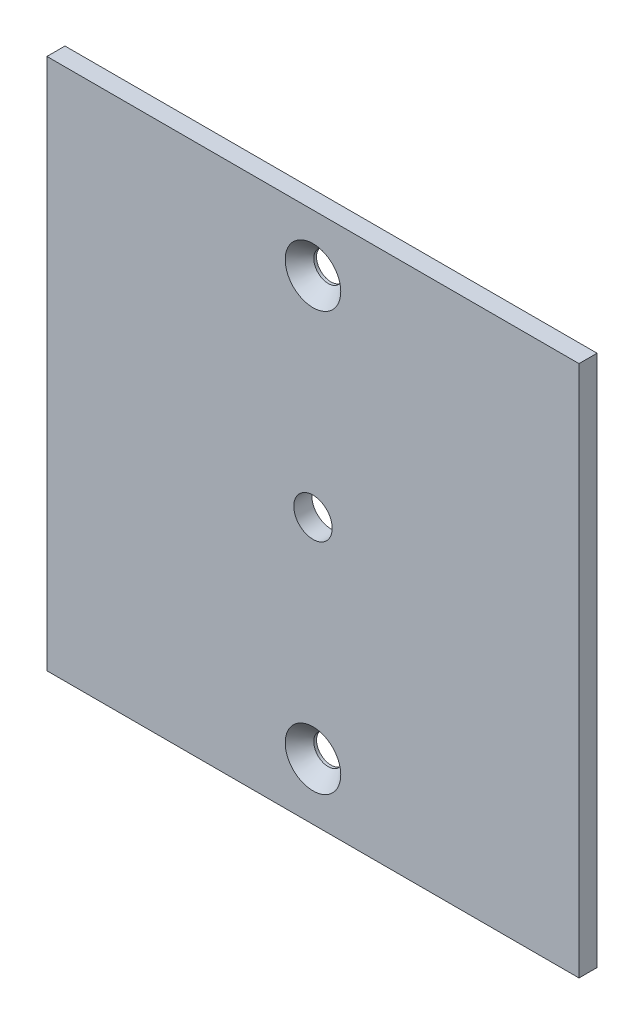
ISO-10303-21;
HEADER;
FILE_DESCRIPTION(('STEP AP214'),'2;1');
FILE_NAME('part.step','',(''),(''),'','','');
FILE_SCHEMA(('AUTOMOTIVE_DESIGN { 1 0 10303 214 1 1 1 1 }'));
ENDSEC;
DATA;
#1=APPLICATION_CONTEXT('core data for automotive mechanical design processes');
#2=APPLICATION_PROTOCOL_DEFINITION('international standard','automotive_design',2000,#1);
#3=PRODUCT_CONTEXT('',#1,'mechanical');
#4=PRODUCT('Part','Part','',(#3));
#5=PRODUCT_RELATED_PRODUCT_CATEGORY('part','',(#4));
#6=PRODUCT_DEFINITION_FORMATION('','',#4);
#7=PRODUCT_DEFINITION_CONTEXT('part definition',#1,'design');
#8=PRODUCT_DEFINITION('design','',#6,#7);
#9=PRODUCT_DEFINITION_SHAPE('','',#8);
#10=(LENGTH_UNIT() NAMED_UNIT(*) SI_UNIT(.MILLI.,.METRE.));
#11=(NAMED_UNIT(*) PLANE_ANGLE_UNIT() SI_UNIT($,.RADIAN.));
#12=(NAMED_UNIT(*) SI_UNIT($,.STERADIAN.) SOLID_ANGLE_UNIT());
#13=UNCERTAINTY_MEASURE_WITH_UNIT(LENGTH_MEASURE(1.E-05),#10,'distance_accuracy_value','');
#14=(GEOMETRIC_REPRESENTATION_CONTEXT(3) GLOBAL_UNCERTAINTY_ASSIGNED_CONTEXT((#13)) GLOBAL_UNIT_ASSIGNED_CONTEXT((#10,
#11,#12)) REPRESENTATION_CONTEXT('',''));
#15=CARTESIAN_POINT('',(0.,0.,0.));
#16=DIRECTION('',(0.,0.,1.));
#17=DIRECTION('',(1.,0.,0.));
#18=AXIS2_PLACEMENT_3D('',#15,#16,#17);
#19=CARTESIAN_POINT('',(46.824999949,-46.824999949,3.175));
#20=DIRECTION('',(-1.,0.,0.));
#21=DIRECTION('',(0.,0.,1.));
#22=AXIS2_PLACEMENT_3D('',#19,#20,#21);
#23=PLANE('',#22);
#24=DIRECTION('',(0.,1.,0.));
#25=VECTOR('',#24,1.);
#26=CARTESIAN_POINT('',(46.824999949,-46.824999949,0.));
#27=LINE('',#26,#25);
#28=CARTESIAN_POINT('',(46.824999949,-46.824999949,0.));
#29=VERTEX_POINT('',#28);
#30=CARTESIAN_POINT('',(46.824999949,46.824999949,0.));
#31=VERTEX_POINT('',#30);
#32=EDGE_CURVE('E105',#29,#31,#27,.T.);
#33=ORIENTED_EDGE('',*,*,#32,.T.);
#34=DIRECTION('',(0.,0.,-1.));
#35=VECTOR('',#34,1.);
#36=CARTESIAN_POINT('',(46.824999949,46.824999949,3.175));
#37=LINE('',#36,#35);
#38=CARTESIAN_POINT('',(46.824999949,46.824999949,3.175));
#39=VERTEX_POINT('',#38);
#40=EDGE_CURVE('E11',#39,#31,#37,.T.);
#41=ORIENTED_EDGE('',*,*,#40,.F.);
#42=DIRECTION('',(0.,1.,0.));
#43=VECTOR('',#42,1.);
#44=CARTESIAN_POINT('',(46.824999949,-46.824999949,3.175));
#45=LINE('',#44,#43);
#46=CARTESIAN_POINT('',(46.824999949,-46.824999949,3.175));
#47=VERTEX_POINT('',#46);
#48=EDGE_CURVE('E92',#47,#39,#45,.T.);
#49=ORIENTED_EDGE('',*,*,#48,.F.);
#50=DIRECTION('',(0.,0.,-1.));
#51=VECTOR('',#50,1.);
#52=CARTESIAN_POINT('',(46.824999949,-46.824999949,3.175));
#53=LINE('',#52,#51);
#54=EDGE_CURVE('E101',#47,#29,#53,.T.);
#55=ORIENTED_EDGE('',*,*,#54,.T.);
#56=EDGE_LOOP('',(#33,#41,#49,#55));
#57=FACE_BOUND('',#56,.T.);
#58=ADVANCED_FACE('F39',(#57),#23,.F.);
#59=CARTESIAN_POINT('',(-46.824999949,46.824999949,3.175));
#60=DIRECTION('',(0.,-1.,0.));
#61=DIRECTION('',(0.,0.,-1.));
#62=AXIS2_PLACEMENT_3D('',#59,#60,#61);
#63=PLANE('',#62);
#64=DIRECTION('',(-1.,0.,0.));
#65=VECTOR('',#64,1.);
#66=CARTESIAN_POINT('',(-46.824999949,46.824999949,0.));
#67=LINE('',#66,#65);
#68=CARTESIAN_POINT('',(-46.824999949,46.824999949,0.));
#69=VERTEX_POINT('',#68);
#70=EDGE_CURVE('E96',#31,#69,#67,.T.);
#71=ORIENTED_EDGE('',*,*,#70,.T.);
#72=DIRECTION('',(0.,0.,-1.));
#73=VECTOR('',#72,1.);
#74=CARTESIAN_POINT('',(-46.824999949,46.824999949,3.175));
#75=LINE('',#74,#73);
#76=CARTESIAN_POINT('',(-46.824999949,46.824999949,3.175));
#77=VERTEX_POINT('',#76);
#78=EDGE_CURVE('E48',#77,#69,#75,.T.);
#79=ORIENTED_EDGE('',*,*,#78,.F.);
#80=DIRECTION('',(-1.,0.,0.));
#81=VECTOR('',#80,1.);
#82=CARTESIAN_POINT('',(-46.824999949,46.824999949,3.175));
#83=LINE('',#82,#81);
#84=EDGE_CURVE('E87',#39,#77,#83,.T.);
#85=ORIENTED_EDGE('',*,*,#84,.F.);
#86=ORIENTED_EDGE('',*,*,#40,.T.);
#87=EDGE_LOOP('',(#71,#79,#85,#86));
#88=FACE_BOUND('',#87,.T.);
#89=ADVANCED_FACE('F95',(#88),#63,.F.);
#90=CARTESIAN_POINT('',(-46.824999949,-46.824999949,3.175));
#91=DIRECTION('',(1.,0.,0.));
#92=DIRECTION('',(0.,0.,-1.));
#93=AXIS2_PLACEMENT_3D('',#90,#91,#92);
#94=PLANE('',#93);
#95=DIRECTION('',(0.,-1.,0.));
#96=VECTOR('',#95,1.);
#97=CARTESIAN_POINT('',(-46.824999949,-46.824999949,0.));
#98=LINE('',#97,#96);
#99=CARTESIAN_POINT('',(-46.824999949,-46.824999949,0.));
#100=VERTEX_POINT('',#99);
#101=EDGE_CURVE('E74',#69,#100,#98,.T.);
#102=ORIENTED_EDGE('',*,*,#101,.T.);
#103=DIRECTION('',(0.,0.,-1.));
#104=VECTOR('',#103,1.);
#105=CARTESIAN_POINT('',(-46.824999949,-46.824999949,3.175));
#106=LINE('',#105,#104);
#107=CARTESIAN_POINT('',(-46.824999949,-46.824999949,3.175));
#108=VERTEX_POINT('',#107);
#109=EDGE_CURVE('E97',#108,#100,#106,.T.);
#110=ORIENTED_EDGE('',*,*,#109,.F.);
#111=DIRECTION('',(0.,-1.,0.));
#112=VECTOR('',#111,1.);
#113=CARTESIAN_POINT('',(-46.824999949,-46.824999949,3.175));
#114=LINE('',#113,#112);
#115=EDGE_CURVE('E90',#77,#108,#114,.T.);
#116=ORIENTED_EDGE('',*,*,#115,.F.);
#117=ORIENTED_EDGE('',*,*,#78,.T.);
#118=EDGE_LOOP('',(#102,#110,#116,#117));
#119=FACE_BOUND('',#118,.T.);
#120=ADVANCED_FACE('F99',(#119),#94,.F.);
#121=CARTESIAN_POINT('',(-46.824999949,-46.824999949,3.175));
#122=DIRECTION('',(0.,1.,0.));
#123=DIRECTION('',(0.,0.,1.));
#124=AXIS2_PLACEMENT_3D('',#121,#122,#123);
#125=PLANE('',#124);
#126=DIRECTION('',(1.,0.,0.));
#127=VECTOR('',#126,1.);
#128=CARTESIAN_POINT('',(-46.824999949,-46.824999949,0.));
#129=LINE('',#128,#127);
#130=EDGE_CURVE('E80',#100,#29,#129,.T.);
#131=ORIENTED_EDGE('',*,*,#130,.T.);
#132=ORIENTED_EDGE('',*,*,#54,.F.);
#133=DIRECTION('',(1.,0.,0.));
#134=VECTOR('',#133,1.);
#135=CARTESIAN_POINT('',(-46.824999949,-46.824999949,3.175));
#136=LINE('',#135,#134);
#137=EDGE_CURVE('E57',#108,#47,#136,.T.);
#138=ORIENTED_EDGE('',*,*,#137,.F.);
#139=ORIENTED_EDGE('',*,*,#109,.T.);
#140=EDGE_LOOP('',(#131,#132,#138,#139));
#141=FACE_BOUND('',#140,.T.);
#142=ADVANCED_FACE('F143',(#141),#125,.F.);
#143=CARTESIAN_POINT('',(0.,0.,3.175));
#144=DIRECTION('',(0.,0.,-1.));
#145=DIRECTION('',(-1.,0.,0.));
#146=AXIS2_PLACEMENT_3D('',#143,#144,#145);
#147=PLANE('',#146);
#148=CARTESIAN_POINT('',(0.,36.8249999489999,3.175));
#149=DIRECTION('',(0.,0.,1.));
#150=DIRECTION('',(1.,0.,0.));
#151=AXIS2_PLACEMENT_3D('',#148,#149,#150);
#152=CIRCLE('',#151,4.8895);
#153=CARTESIAN_POINT('',(4.88949999999999,36.8249999489999,3.175));
#154=VERTEX_POINT('',#153);
#155=EDGE_CURVE('E237',#154,#154,#152,.T.);
#156=ORIENTED_EDGE('',*,*,#155,.F.);
#157=EDGE_LOOP('',(#156));
#158=FACE_BOUND('',#157,.T.);
#159=CARTESIAN_POINT('',(-2.17950657521726E-13,-36.8249999489999,3.175));
#160=DIRECTION('',(0.,0.,1.));
#161=DIRECTION('',(1.,0.,0.));
#162=AXIS2_PLACEMENT_3D('',#159,#160,#161);
#163=CIRCLE('',#162,4.8895);
#164=CARTESIAN_POINT('',(4.88949999999978,-36.8249999489999,3.175));
#165=VERTEX_POINT('',#164);
#166=EDGE_CURVE('E122',#165,#165,#163,.T.);
#167=ORIENTED_EDGE('',*,*,#166,.F.);
#168=EDGE_LOOP('',(#167));
#169=FACE_BOUND('',#168,.T.);
#170=CARTESIAN_POINT('',(0.,0.,3.175));
#171=DIRECTION('',(0.,0.,1.));
#172=DIRECTION('',(1.,0.,0.));
#173=AXIS2_PLACEMENT_3D('',#170,#171,#172);
#174=CIRCLE('',#173,3.3782);
#175=CARTESIAN_POINT('',(3.3782,0.,3.175));
#176=VERTEX_POINT('',#175);
#177=EDGE_CURVE('E115',#176,#176,#174,.T.);
#178=ORIENTED_EDGE('',*,*,#177,.F.);
#179=EDGE_LOOP('',(#178));
#180=FACE_BOUND('',#179,.T.);
#181=ORIENTED_EDGE('',*,*,#48,.T.);
#182=ORIENTED_EDGE('',*,*,#84,.T.);
#183=ORIENTED_EDGE('',*,*,#115,.T.);
#184=ORIENTED_EDGE('',*,*,#137,.T.);
#185=EDGE_LOOP('',(#181,#182,#183,#184));
#186=FACE_BOUND('',#185,.T.);
#187=ADVANCED_FACE('F88',(#158,#169,#180,#186),#147,.F.);
#188=CARTESIAN_POINT('',(0.,0.,0.));
#189=DIRECTION('',(0.,0.,-1.));
#190=DIRECTION('',(-1.,0.,0.));
#191=AXIS2_PLACEMENT_3D('',#188,#189,#190);
#192=PLANE('',#191);
#193=CARTESIAN_POINT('',(0.,36.8249999489999,0.));
#194=DIRECTION('',(0.,0.,-1.));
#195=DIRECTION('',(-1.,0.,0.));
#196=AXIS2_PLACEMENT_3D('',#193,#194,#195);
#197=CIRCLE('',#196,2.5527);
#198=CARTESIAN_POINT('',(-2.55270000000001,36.8249999489999,0.));
#199=VERTEX_POINT('',#198);
#200=EDGE_CURVE('E42',#199,#199,#197,.T.);
#201=ORIENTED_EDGE('',*,*,#200,.F.);
#202=EDGE_LOOP('',(#201));
#203=FACE_BOUND('',#202,.T.);
#204=CARTESIAN_POINT('',(-2.17950657521726E-13,-36.8249999489999,0.));
#205=DIRECTION('',(0.,0.,-1.));
#206=DIRECTION('',(-1.,0.,0.));
#207=AXIS2_PLACEMENT_3D('',#204,#205,#206);
#208=CIRCLE('',#207,2.5527);
#209=CARTESIAN_POINT('',(-2.55270000000022,-36.8249999489999,0.));
#210=VERTEX_POINT('',#209);
#211=EDGE_CURVE('E113',#210,#210,#208,.T.);
#212=ORIENTED_EDGE('',*,*,#211,.F.);
#213=EDGE_LOOP('',(#212));
#214=FACE_BOUND('',#213,.T.);
#215=CARTESIAN_POINT('',(0.,0.,0.));
#216=DIRECTION('',(0.,0.,-1.));
#217=DIRECTION('',(-1.,0.,0.));
#218=AXIS2_PLACEMENT_3D('',#215,#216,#217);
#219=CIRCLE('',#218,3.3782);
#220=CARTESIAN_POINT('',(-3.3782,0.,0.));
#221=VERTEX_POINT('',#220);
#222=EDGE_CURVE('E108',#221,#221,#219,.T.);
#223=ORIENTED_EDGE('',*,*,#222,.F.);
#224=EDGE_LOOP('',(#223));
#225=FACE_BOUND('',#224,.T.);
#226=ORIENTED_EDGE('',*,*,#32,.F.);
#227=ORIENTED_EDGE('',*,*,#130,.F.);
#228=ORIENTED_EDGE('',*,*,#101,.F.);
#229=ORIENTED_EDGE('',*,*,#70,.F.);
#230=EDGE_LOOP('',(#226,#227,#228,#229));
#231=FACE_BOUND('',#230,.T.);
#232=ADVANCED_FACE('F136',(#203,#214,#225,#231),#192,.T.);
#233=CARTESIAN_POINT('',(0.,0.,3.175));
#234=DIRECTION('',(0.,0.,1.));
#235=DIRECTION('',(1.,0.,0.));
#236=AXIS2_PLACEMENT_3D('',#233,#234,#235);
#237=CYLINDRICAL_SURFACE('',#236,3.3782);
#238=ORIENTED_EDGE('',*,*,#222,.T.);
#239=EDGE_LOOP('',(#238));
#240=FACE_BOUND('',#239,.T.);
#241=ORIENTED_EDGE('',*,*,#177,.T.);
#242=EDGE_LOOP('',(#241));
#243=FACE_BOUND('',#242,.T.);
#244=ADVANCED_FACE('F133',(#240,#243),#237,.F.);
#245=CARTESIAN_POINT('',(-2.17950657521726E-13,-36.8249999489999,3.175));
#246=DIRECTION('',(0.,0.,1.));
#247=DIRECTION('',(1.,0.,0.));
#248=AXIS2_PLACEMENT_3D('',#245,#246,#247);
#249=CYLINDRICAL_SURFACE('',#248,2.5527);
#250=ORIENTED_EDGE('',*,*,#211,.T.);
#251=EDGE_LOOP('',(#250));
#252=FACE_BOUND('',#251,.T.);
#253=CARTESIAN_POINT('',(-2.17950657521726E-13,-36.8249999489999,0.486819106005945));
#254=DIRECTION('',(0.,0.,1.));
#255=DIRECTION('',(1.,0.,0.));
#256=AXIS2_PLACEMENT_3D('',#253,#254,#255);
#257=CIRCLE('',#256,2.5527);
#258=CARTESIAN_POINT('',(2.55269999999978,-36.8249999489999,0.486819106005945));
#259=VERTEX_POINT('',#258);
#260=EDGE_CURVE('E116',#259,#259,#257,.T.);
#261=ORIENTED_EDGE('',*,*,#260,.T.);
#262=EDGE_LOOP('',(#261));
#263=FACE_BOUND('',#262,.T.);
#264=ADVANCED_FACE('F191',(#252,#263),#249,.F.);
#265=CARTESIAN_POINT('',(-2.17950657521726E-13,-36.8249999489999,3.175));
#266=DIRECTION('',(0.,0.,1.));
#267=DIRECTION('',(1.,0.,0.));
#268=AXIS2_PLACEMENT_3D('',#265,#266,#267);
#269=CONICAL_SURFACE('',#268,4.8895,0.715584993317675);
#270=ORIENTED_EDGE('',*,*,#260,.F.);
#271=EDGE_LOOP('',(#270));
#272=FACE_BOUND('',#271,.T.);
#273=ORIENTED_EDGE('',*,*,#166,.T.);
#274=EDGE_LOOP('',(#273));
#275=FACE_BOUND('',#274,.T.);
#276=ADVANCED_FACE('F199',(#272,#275),#269,.F.);
#277=CARTESIAN_POINT('',(0.,36.8249999489999,3.175));
#278=DIRECTION('',(0.,0.,1.));
#279=DIRECTION('',(1.,0.,0.));
#280=AXIS2_PLACEMENT_3D('',#277,#278,#279);
#281=CYLINDRICAL_SURFACE('',#280,2.5527);
#282=ORIENTED_EDGE('',*,*,#200,.T.);
#283=EDGE_LOOP('',(#282));
#284=FACE_BOUND('',#283,.T.);
#285=CARTESIAN_POINT('',(0.,36.8249999489999,0.486819106005945));
#286=DIRECTION('',(0.,0.,1.));
#287=DIRECTION('',(1.,0.,0.));
#288=AXIS2_PLACEMENT_3D('',#285,#286,#287);
#289=CIRCLE('',#288,2.5527);
#290=CARTESIAN_POINT('',(2.55269999999999,36.8249999489999,0.486819106005945));
#291=VERTEX_POINT('',#290);
#292=EDGE_CURVE('E234',#291,#291,#289,.T.);
#293=ORIENTED_EDGE('',*,*,#292,.T.);
#294=EDGE_LOOP('',(#293));
#295=FACE_BOUND('',#294,.T.);
#296=ADVANCED_FACE('F208',(#284,#295),#281,.F.);
#297=CARTESIAN_POINT('',(0.,36.8249999489999,3.175));
#298=DIRECTION('',(0.,0.,1.));
#299=DIRECTION('',(1.,0.,0.));
#300=AXIS2_PLACEMENT_3D('',#297,#298,#299);
#301=CONICAL_SURFACE('',#300,4.8895,0.715584993317675);
#302=ORIENTED_EDGE('',*,*,#292,.F.);
#303=EDGE_LOOP('',(#302));
#304=FACE_BOUND('',#303,.T.);
#305=ORIENTED_EDGE('',*,*,#155,.T.);
#306=EDGE_LOOP('',(#305));
#307=FACE_BOUND('',#306,.T.);
#308=ADVANCED_FACE('F218',(#304,#307),#301,.F.);
#309=CLOSED_SHELL('',(#58,#89,#120,#142,#187,#232,#244,#264,#276,#296,#308));
#310=MANIFOLD_SOLID_BREP('B2',#309);
#311=ADVANCED_BREP_SHAPE_REPRESENTATION('',(#18,#310),#14);
#312=SHAPE_DEFINITION_REPRESENTATION(#9,#311);
ENDSEC;
END-ISO-10303-21;
